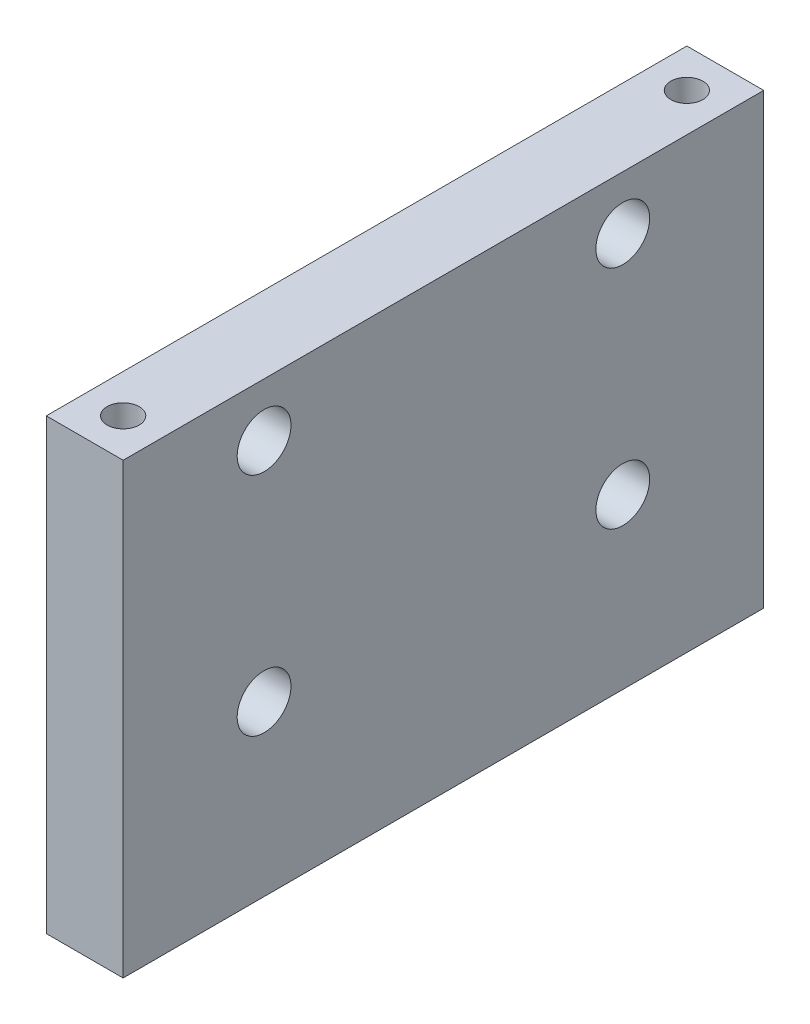
ISO-10303-21;
HEADER;
FILE_DESCRIPTION(('STEP AP214'),'2;1');
FILE_NAME('part.step','',(''),(''),'','','');
FILE_SCHEMA(('AUTOMOTIVE_DESIGN { 1 0 10303 214 1 1 1 1 }'));
ENDSEC;
DATA;
#1=APPLICATION_CONTEXT('core data for automotive mechanical design processes');
#2=APPLICATION_PROTOCOL_DEFINITION('international standard','automotive_design',2000,#1);
#3=PRODUCT_CONTEXT('',#1,'mechanical');
#4=PRODUCT('Part','Part','',(#3));
#5=PRODUCT_RELATED_PRODUCT_CATEGORY('part','',(#4));
#6=PRODUCT_DEFINITION_FORMATION('','',#4);
#7=PRODUCT_DEFINITION_CONTEXT('part definition',#1,'design');
#8=PRODUCT_DEFINITION('design','',#6,#7);
#9=PRODUCT_DEFINITION_SHAPE('','',#8);
#10=(LENGTH_UNIT() NAMED_UNIT(*) SI_UNIT(.MILLI.,.METRE.));
#11=(NAMED_UNIT(*) PLANE_ANGLE_UNIT() SI_UNIT($,.RADIAN.));
#12=(NAMED_UNIT(*) SI_UNIT($,.STERADIAN.) SOLID_ANGLE_UNIT());
#13=UNCERTAINTY_MEASURE_WITH_UNIT(LENGTH_MEASURE(1.E-05),#10,'distance_accuracy_value','');
#14=(GEOMETRIC_REPRESENTATION_CONTEXT(3) GLOBAL_UNCERTAINTY_ASSIGNED_CONTEXT((#13)) GLOBAL_UNIT_ASSIGNED_CONTEXT((#10,
#11,#12)) REPRESENTATION_CONTEXT('',''));
#15=CARTESIAN_POINT('',(0.,0.,0.));
#16=DIRECTION('',(0.,0.,1.));
#17=DIRECTION('',(1.,0.,0.));
#18=AXIS2_PLACEMENT_3D('',#15,#16,#17);
#19=CARTESIAN_POINT('',(0.,0.,0.));
#20=DIRECTION('',(0.,-1.,0.));
#21=DIRECTION('',(1.,0.,0.));
#22=AXIS2_PLACEMENT_3D('',#19,#20,#21);
#23=PLANE('',#22);
#24=CARTESIAN_POINT('',(-22.,0.,-22.));
#25=DIRECTION('',(0.,1.,0.));
#26=DIRECTION('',(0.,0.,-1.));
#27=AXIS2_PLACEMENT_3D('',#24,#25,#26);
#28=CIRCLE('',#27,1.25);
#29=CARTESIAN_POINT('',(-22.,0.,-23.25));
#30=VERTEX_POINT('',#29);
#31=EDGE_CURVE('E184',#30,#30,#28,.T.);
#32=ORIENTED_EDGE('',*,*,#31,.F.);
#33=EDGE_LOOP('',(#32));
#34=FACE_BOUND('',#33,.T.);
#35=DIRECTION('',(0.,0.,1.));
#36=VECTOR('',#35,1.);
#37=CARTESIAN_POINT('',(-25.,0.,0.));
#38=LINE('',#37,#36);
#39=CARTESIAN_POINT('',(-25.,0.,-25.));
#40=VERTEX_POINT('',#39);
#41=CARTESIAN_POINT('',(-25.,0.,25.));
#42=VERTEX_POINT('',#41);
#43=EDGE_CURVE('E27',#40,#42,#38,.T.);
#44=ORIENTED_EDGE('',*,*,#43,.T.);
#45=DIRECTION('',(1.,0.,0.));
#46=VECTOR('',#45,1.);
#47=CARTESIAN_POINT('',(0.,0.,25.));
#48=LINE('',#47,#46);
#49=CARTESIAN_POINT('',(-19.,0.,25.));
#50=VERTEX_POINT('',#49);
#51=EDGE_CURVE('E11',#42,#50,#48,.T.);
#52=ORIENTED_EDGE('',*,*,#51,.T.);
#53=DIRECTION('',(0.,0.,-1.));
#54=VECTOR('',#53,1.);
#55=CARTESIAN_POINT('',(-19.,0.,23.5));
#56=LINE('',#55,#54);
#57=CARTESIAN_POINT('',(-19.,0.,-25.));
#58=VERTEX_POINT('',#57);
#59=EDGE_CURVE('E113',#50,#58,#56,.T.);
#60=ORIENTED_EDGE('',*,*,#59,.T.);
#61=DIRECTION('',(1.,0.,0.));
#62=VECTOR('',#61,1.);
#63=CARTESIAN_POINT('',(0.,0.,-25.));
#64=LINE('',#63,#62);
#65=EDGE_CURVE('E111',#40,#58,#64,.T.);
#66=ORIENTED_EDGE('',*,*,#65,.F.);
#67=EDGE_LOOP('',(#44,#52,#60,#66));
#68=FACE_BOUND('',#67,.T.);
#69=CARTESIAN_POINT('',(-22.,0.,22.));
#70=DIRECTION('',(0.,-1.,0.));
#71=DIRECTION('',(0.,0.,-1.));
#72=AXIS2_PLACEMENT_3D('',#69,#70,#71);
#73=CIRCLE('',#72,1.25);
#74=CARTESIAN_POINT('',(-22.,0.,20.75));
#75=VERTEX_POINT('',#74);
#76=EDGE_CURVE('E194',#75,#75,#73,.T.);
#77=ORIENTED_EDGE('',*,*,#76,.T.);
#78=EDGE_LOOP('',(#77));
#79=FACE_BOUND('',#78,.T.);
#80=ADVANCED_FACE('F17',(#34,#68,#79),#23,.F.);
#81=CARTESIAN_POINT('',(15.6554577499628,-35.,0.));
#82=DIRECTION('',(0.,-1.,0.));
#83=DIRECTION('',(1.,0.,0.));
#84=AXIS2_PLACEMENT_3D('',#81,#82,#83);
#85=PLANE('',#84);
#86=CARTESIAN_POINT('',(-22.,-35.,-22.));
#87=DIRECTION('',(0.,1.,0.));
#88=DIRECTION('',(0.,0.,-1.));
#89=AXIS2_PLACEMENT_3D('',#86,#87,#88);
#90=CIRCLE('',#89,1.25);
#91=CARTESIAN_POINT('',(-22.,-35.,-23.25));
#92=VERTEX_POINT('',#91);
#93=EDGE_CURVE('E121',#92,#92,#90,.T.);
#94=ORIENTED_EDGE('',*,*,#93,.T.);
#95=EDGE_LOOP('',(#94));
#96=FACE_BOUND('',#95,.T.);
#97=DIRECTION('',(0.,0.,1.));
#98=VECTOR('',#97,1.);
#99=CARTESIAN_POINT('',(-25.,-35.,0.));
#100=LINE('',#99,#98);
#101=CARTESIAN_POINT('',(-25.,-35.,-25.));
#102=VERTEX_POINT('',#101);
#103=CARTESIAN_POINT('',(-25.,-35.,25.));
#104=VERTEX_POINT('',#103);
#105=EDGE_CURVE('E74',#102,#104,#100,.T.);
#106=ORIENTED_EDGE('',*,*,#105,.F.);
#107=DIRECTION('',(1.,0.,0.));
#108=VECTOR('',#107,1.);
#109=CARTESIAN_POINT('',(0.,-35.,-25.));
#110=LINE('',#109,#108);
#111=CARTESIAN_POINT('',(-19.,-35.,-25.));
#112=VERTEX_POINT('',#111);
#113=EDGE_CURVE('E89',#102,#112,#110,.T.);
#114=ORIENTED_EDGE('',*,*,#113,.T.);
#115=DIRECTION('',(0.,0.,-1.));
#116=VECTOR('',#115,1.);
#117=CARTESIAN_POINT('',(-19.,-35.,23.5));
#118=LINE('',#117,#116);
#119=CARTESIAN_POINT('',(-19.,-35.,25.));
#120=VERTEX_POINT('',#119);
#121=EDGE_CURVE('E92',#120,#112,#118,.T.);
#122=ORIENTED_EDGE('',*,*,#121,.F.);
#123=DIRECTION('',(1.,0.,0.));
#124=VECTOR('',#123,1.);
#125=CARTESIAN_POINT('',(0.,-35.,25.));
#126=LINE('',#125,#124);
#127=EDGE_CURVE('E82',#104,#120,#126,.T.);
#128=ORIENTED_EDGE('',*,*,#127,.F.);
#129=EDGE_LOOP('',(#106,#114,#122,#128));
#130=FACE_BOUND('',#129,.T.);
#131=CARTESIAN_POINT('',(-22.,-35.,22.));
#132=DIRECTION('',(0.,-1.,0.));
#133=DIRECTION('',(0.,0.,-1.));
#134=AXIS2_PLACEMENT_3D('',#131,#132,#133);
#135=CIRCLE('',#134,1.25);
#136=CARTESIAN_POINT('',(-22.,-35.,20.75));
#137=VERTEX_POINT('',#136);
#138=EDGE_CURVE('E103',#137,#137,#135,.T.);
#139=ORIENTED_EDGE('',*,*,#138,.F.);
#140=EDGE_LOOP('',(#139));
#141=FACE_BOUND('',#140,.T.);
#142=ADVANCED_FACE('F86',(#96,#130,#141),#85,.T.);
#143=CARTESIAN_POINT('',(0.,-35.002,-25.));
#144=DIRECTION('',(0.,0.,1.));
#145=DIRECTION('',(1.,0.,0.));
#146=AXIS2_PLACEMENT_3D('',#143,#144,#145);
#147=PLANE('',#146);
#148=ORIENTED_EDGE('',*,*,#113,.F.);
#149=DIRECTION('',(0.,1.,0.));
#150=VECTOR('',#149,1.);
#151=CARTESIAN_POINT('',(-25.,-35.002,-25.));
#152=LINE('',#151,#150);
#153=EDGE_CURVE('E71',#102,#40,#152,.T.);
#154=ORIENTED_EDGE('',*,*,#153,.T.);
#155=ORIENTED_EDGE('',*,*,#65,.T.);
#156=DIRECTION('',(0.,1.,0.));
#157=VECTOR('',#156,1.);
#158=CARTESIAN_POINT('',(-19.,-35.002,-25.));
#159=LINE('',#158,#157);
#160=EDGE_CURVE('E81',#112,#58,#159,.T.);
#161=ORIENTED_EDGE('',*,*,#160,.F.);
#162=EDGE_LOOP('',(#148,#154,#155,#161));
#163=FACE_BOUND('',#162,.T.);
#164=ADVANCED_FACE('F94',(#163),#147,.F.);
#165=CARTESIAN_POINT('',(-19.,-35.002,23.5));
#166=DIRECTION('',(1.,0.,0.));
#167=DIRECTION('',(0.,0.,-1.));
#168=AXIS2_PLACEMENT_3D('',#165,#166,#167);
#169=PLANE('',#168);
#170=CARTESIAN_POINT('',(-19.,-21.8226209229073,14.));
#171=DIRECTION('',(1.,0.,0.));
#172=DIRECTION('',(0.,0.,-1.));
#173=AXIS2_PLACEMENT_3D('',#170,#171,#172);
#174=CIRCLE('',#173,2.1);
#175=CARTESIAN_POINT('',(-19.,-21.8226209229073,11.9));
#176=VERTEX_POINT('',#175);
#177=EDGE_CURVE('E163',#176,#176,#174,.F.);
#178=ORIENTED_EDGE('',*,*,#177,.T.);
#179=EDGE_LOOP('',(#178));
#180=FACE_BOUND('',#179,.T.);
#181=CARTESIAN_POINT('',(-19.,-4.17737907709263,-14.));
#182=DIRECTION('',(1.,0.,0.));
#183=DIRECTION('',(0.,0.,-1.));
#184=AXIS2_PLACEMENT_3D('',#181,#182,#183);
#185=CIRCLE('',#184,2.1);
#186=CARTESIAN_POINT('',(-19.,-4.17737907709263,-16.1));
#187=VERTEX_POINT('',#186);
#188=EDGE_CURVE('E167',#187,#187,#185,.F.);
#189=ORIENTED_EDGE('',*,*,#188,.T.);
#190=EDGE_LOOP('',(#189));
#191=FACE_BOUND('',#190,.T.);
#192=CARTESIAN_POINT('',(-19.,-21.8226209229073,-14.));
#193=DIRECTION('',(1.,0.,0.));
#194=DIRECTION('',(0.,0.,-1.));
#195=AXIS2_PLACEMENT_3D('',#192,#193,#194);
#196=CIRCLE('',#195,2.1);
#197=CARTESIAN_POINT('',(-19.,-21.8226209229073,-16.1));
#198=VERTEX_POINT('',#197);
#199=EDGE_CURVE('E171',#198,#198,#196,.F.);
#200=ORIENTED_EDGE('',*,*,#199,.T.);
#201=EDGE_LOOP('',(#200));
#202=FACE_BOUND('',#201,.T.);
#203=CARTESIAN_POINT('',(-19.,-4.17737907709263,14.));
#204=DIRECTION('',(1.,0.,0.));
#205=DIRECTION('',(0.,0.,-1.));
#206=AXIS2_PLACEMENT_3D('',#203,#204,#205);
#207=CIRCLE('',#206,2.1);
#208=CARTESIAN_POINT('',(-19.,-4.17737907709263,11.9));
#209=VERTEX_POINT('',#208);
#210=EDGE_CURVE('E174',#209,#209,#207,.F.);
#211=ORIENTED_EDGE('',*,*,#210,.T.);
#212=EDGE_LOOP('',(#211));
#213=FACE_BOUND('',#212,.T.);
#214=DIRECTION('',(0.,1.,0.));
#215=VECTOR('',#214,1.);
#216=CARTESIAN_POINT('',(-19.,-35.002,25.));
#217=LINE('',#216,#215);
#218=EDGE_CURVE('E48',#120,#50,#217,.T.);
#219=ORIENTED_EDGE('',*,*,#218,.F.);
#220=ORIENTED_EDGE('',*,*,#121,.T.);
#221=ORIENTED_EDGE('',*,*,#160,.T.);
#222=ORIENTED_EDGE('',*,*,#59,.F.);
#223=EDGE_LOOP('',(#219,#220,#221,#222));
#224=FACE_BOUND('',#223,.T.);
#225=ADVANCED_FACE('F129',(#180,#191,#202,#213,#224),#169,.T.);
#226=CARTESIAN_POINT('',(-25.,-35.002,0.));
#227=DIRECTION('',(-1.,0.,0.));
#228=DIRECTION('',(0.,0.,1.));
#229=AXIS2_PLACEMENT_3D('',#226,#227,#228);
#230=PLANE('',#229);
#231=CARTESIAN_POINT('',(-25.,-21.8226209229073,14.));
#232=DIRECTION('',(-1.,0.,0.));
#233=DIRECTION('',(0.,0.,1.));
#234=AXIS2_PLACEMENT_3D('',#231,#232,#233);
#235=CIRCLE('',#234,2.1);
#236=CARTESIAN_POINT('',(-25.,-21.8226209229073,16.1));
#237=VERTEX_POINT('',#236);
#238=EDGE_CURVE('E178',#237,#237,#235,.T.);
#239=ORIENTED_EDGE('',*,*,#238,.F.);
#240=EDGE_LOOP('',(#239));
#241=FACE_BOUND('',#240,.T.);
#242=CARTESIAN_POINT('',(-25.,-4.17737907709263,-14.));
#243=DIRECTION('',(-1.,0.,0.));
#244=DIRECTION('',(0.,0.,1.));
#245=AXIS2_PLACEMENT_3D('',#242,#243,#244);
#246=CIRCLE('',#245,2.1);
#247=CARTESIAN_POINT('',(-25.,-4.17737907709263,-11.9));
#248=VERTEX_POINT('',#247);
#249=EDGE_CURVE('E396',#248,#248,#246,.T.);
#250=ORIENTED_EDGE('',*,*,#249,.F.);
#251=EDGE_LOOP('',(#250));
#252=FACE_BOUND('',#251,.T.);
#253=CARTESIAN_POINT('',(-25.,-21.8226209229073,-14.));
#254=DIRECTION('',(-1.,0.,0.));
#255=DIRECTION('',(0.,0.,1.));
#256=AXIS2_PLACEMENT_3D('',#253,#254,#255);
#257=CIRCLE('',#256,2.1);
#258=CARTESIAN_POINT('',(-25.,-21.8226209229073,-11.9));
#259=VERTEX_POINT('',#258);
#260=EDGE_CURVE('E404',#259,#259,#257,.T.);
#261=ORIENTED_EDGE('',*,*,#260,.F.);
#262=EDGE_LOOP('',(#261));
#263=FACE_BOUND('',#262,.T.);
#264=CARTESIAN_POINT('',(-25.,-4.17737907709263,14.));
#265=DIRECTION('',(-1.,0.,0.));
#266=DIRECTION('',(0.,0.,1.));
#267=AXIS2_PLACEMENT_3D('',#264,#265,#266);
#268=CIRCLE('',#267,2.1);
#269=CARTESIAN_POINT('',(-25.,-4.17737907709263,16.1));
#270=VERTEX_POINT('',#269);
#271=EDGE_CURVE('E177',#270,#270,#268,.T.);
#272=ORIENTED_EDGE('',*,*,#271,.F.);
#273=EDGE_LOOP('',(#272));
#274=FACE_BOUND('',#273,.T.);
#275=ORIENTED_EDGE('',*,*,#153,.F.);
#276=ORIENTED_EDGE('',*,*,#105,.T.);
#277=DIRECTION('',(0.,1.,0.));
#278=VECTOR('',#277,1.);
#279=CARTESIAN_POINT('',(-25.,-35.002,25.));
#280=LINE('',#279,#278);
#281=EDGE_CURVE('E21',#104,#42,#280,.T.);
#282=ORIENTED_EDGE('',*,*,#281,.T.);
#283=ORIENTED_EDGE('',*,*,#43,.F.);
#284=EDGE_LOOP('',(#275,#276,#282,#283));
#285=FACE_BOUND('',#284,.T.);
#286=ADVANCED_FACE('F73',(#241,#252,#263,#274,#285),#230,.T.);
#287=CARTESIAN_POINT('',(0.,-35.002,25.));
#288=DIRECTION('',(0.,0.,1.));
#289=DIRECTION('',(1.,0.,0.));
#290=AXIS2_PLACEMENT_3D('',#287,#288,#289);
#291=PLANE('',#290);
#292=ORIENTED_EDGE('',*,*,#281,.F.);
#293=ORIENTED_EDGE('',*,*,#127,.T.);
#294=ORIENTED_EDGE('',*,*,#218,.T.);
#295=ORIENTED_EDGE('',*,*,#51,.F.);
#296=EDGE_LOOP('',(#292,#293,#294,#295));
#297=FACE_BOUND('',#296,.T.);
#298=ADVANCED_FACE('F19',(#297),#291,.T.);
#299=CARTESIAN_POINT('',(-22.,-25.,-22.));
#300=DIRECTION('',(0.,-1.,0.));
#301=DIRECTION('',(0.,0.,-1.));
#302=AXIS2_PLACEMENT_3D('',#299,#300,#301);
#303=CYLINDRICAL_SURFACE('',#302,1.25);
#304=CARTESIAN_POINT('',(-22.,-25.,-22.));
#305=DIRECTION('',(0.,1.,0.));
#306=DIRECTION('',(0.,0.,-1.));
#307=AXIS2_PLACEMENT_3D('',#304,#305,#306);
#308=CIRCLE('',#307,1.25);
#309=CARTESIAN_POINT('',(-22.,-25.,-23.25));
#310=VERTEX_POINT('',#309);
#311=EDGE_CURVE('E207',#310,#310,#308,.T.);
#312=ORIENTED_EDGE('',*,*,#311,.T.);
#313=EDGE_LOOP('',(#312));
#314=FACE_BOUND('',#313,.T.);
#315=ORIENTED_EDGE('',*,*,#93,.F.);
#316=EDGE_LOOP('',(#315));
#317=FACE_BOUND('',#316,.T.);
#318=ADVANCED_FACE('F133',(#314,#317),#303,.F.);
#319=CARTESIAN_POINT('',(-0.875,-25.,0.));
#320=DIRECTION('',(0.,-1.,0.));
#321=DIRECTION('',(1.,0.,0.));
#322=AXIS2_PLACEMENT_3D('',#319,#320,#321);
#323=PLANE('',#322);
#324=ORIENTED_EDGE('',*,*,#311,.F.);
#325=EDGE_LOOP('',(#324));
#326=FACE_BOUND('',#325,.T.);
#327=ADVANCED_FACE('F139',(#326),#323,.T.);
#328=CARTESIAN_POINT('',(-22.,-25.,22.));
#329=DIRECTION('',(0.,-1.,0.));
#330=DIRECTION('',(0.,0.,-1.));
#331=AXIS2_PLACEMENT_3D('',#328,#329,#330);
#332=CYLINDRICAL_SURFACE('',#331,1.25);
#333=CARTESIAN_POINT('',(-22.,-25.,22.));
#334=DIRECTION('',(0.,-1.,0.));
#335=DIRECTION('',(0.,0.,-1.));
#336=AXIS2_PLACEMENT_3D('',#333,#334,#335);
#337=CIRCLE('',#336,1.25);
#338=CARTESIAN_POINT('',(-22.,-25.,20.75));
#339=VERTEX_POINT('',#338);
#340=EDGE_CURVE('E96',#339,#339,#337,.T.);
#341=ORIENTED_EDGE('',*,*,#340,.F.);
#342=EDGE_LOOP('',(#341));
#343=FACE_BOUND('',#342,.T.);
#344=ORIENTED_EDGE('',*,*,#138,.T.);
#345=EDGE_LOOP('',(#344));
#346=FACE_BOUND('',#345,.T.);
#347=ADVANCED_FACE('F265',(#343,#346),#332,.F.);
#348=CARTESIAN_POINT('',(-0.875,-25.,0.));
#349=DIRECTION('',(0.,-1.,0.));
#350=DIRECTION('',(1.,0.,0.));
#351=AXIS2_PLACEMENT_3D('',#348,#349,#350);
#352=PLANE('',#351);
#353=ORIENTED_EDGE('',*,*,#340,.T.);
#354=EDGE_LOOP('',(#353));
#355=FACE_BOUND('',#354,.T.);
#356=ADVANCED_FACE('F275',(#355),#352,.T.);
#357=CARTESIAN_POINT('',(-22.,-10.,-22.));
#358=DIRECTION('',(0.,1.,0.));
#359=DIRECTION('',(0.,0.,1.));
#360=AXIS2_PLACEMENT_3D('',#357,#358,#359);
#361=CYLINDRICAL_SURFACE('',#360,1.25);
#362=CARTESIAN_POINT('',(-22.,-10.,-22.));
#363=DIRECTION('',(0.,1.,0.));
#364=DIRECTION('',(0.,0.,-1.));
#365=AXIS2_PLACEMENT_3D('',#362,#363,#364);
#366=CIRCLE('',#365,1.25);
#367=CARTESIAN_POINT('',(-22.,-10.,-23.25));
#368=VERTEX_POINT('',#367);
#369=EDGE_CURVE('E198',#368,#368,#366,.T.);
#370=ORIENTED_EDGE('',*,*,#369,.F.);
#371=EDGE_LOOP('',(#370));
#372=FACE_BOUND('',#371,.T.);
#373=ORIENTED_EDGE('',*,*,#31,.T.);
#374=EDGE_LOOP('',(#373));
#375=FACE_BOUND('',#374,.T.);
#376=ADVANCED_FACE('F285',(#372,#375),#361,.F.);
#377=CARTESIAN_POINT('',(-0.875,-10.,0.));
#378=DIRECTION('',(0.,1.,0.));
#379=DIRECTION('',(1.,0.,0.));
#380=AXIS2_PLACEMENT_3D('',#377,#378,#379);
#381=PLANE('',#380);
#382=ORIENTED_EDGE('',*,*,#369,.T.);
#383=EDGE_LOOP('',(#382));
#384=FACE_BOUND('',#383,.T.);
#385=ADVANCED_FACE('F296',(#384),#381,.T.);
#386=CARTESIAN_POINT('',(-22.,-10.,22.));
#387=DIRECTION('',(0.,1.,0.));
#388=DIRECTION('',(0.,0.,1.));
#389=AXIS2_PLACEMENT_3D('',#386,#387,#388);
#390=CYLINDRICAL_SURFACE('',#389,1.25);
#391=CARTESIAN_POINT('',(-22.,-10.,22.));
#392=DIRECTION('',(0.,-1.,0.));
#393=DIRECTION('',(0.,0.,-1.));
#394=AXIS2_PLACEMENT_3D('',#391,#392,#393);
#395=CIRCLE('',#394,1.25);
#396=CARTESIAN_POINT('',(-22.,-10.,20.75));
#397=VERTEX_POINT('',#396);
#398=EDGE_CURVE('E190',#397,#397,#395,.T.);
#399=ORIENTED_EDGE('',*,*,#398,.T.);
#400=EDGE_LOOP('',(#399));
#401=FACE_BOUND('',#400,.T.);
#402=ORIENTED_EDGE('',*,*,#76,.F.);
#403=EDGE_LOOP('',(#402));
#404=FACE_BOUND('',#403,.T.);
#405=ADVANCED_FACE('F308',(#401,#404),#390,.F.);
#406=CARTESIAN_POINT('',(-0.875,-10.,0.));
#407=DIRECTION('',(0.,1.,0.));
#408=DIRECTION('',(1.,0.,0.));
#409=AXIS2_PLACEMENT_3D('',#406,#407,#408);
#410=PLANE('',#409);
#411=ORIENTED_EDGE('',*,*,#398,.F.);
#412=EDGE_LOOP('',(#411));
#413=FACE_BOUND('',#412,.T.);
#414=ADVANCED_FACE('F320',(#413),#410,.T.);
#415=CARTESIAN_POINT('',(-18.998,-4.17737907709263,14.));
#416=DIRECTION('',(-1.,0.,0.));
#417=DIRECTION('',(0.,0.,1.));
#418=AXIS2_PLACEMENT_3D('',#415,#416,#417);
#419=CYLINDRICAL_SURFACE('',#418,2.1);
#420=ORIENTED_EDGE('',*,*,#271,.T.);
#421=EDGE_LOOP('',(#420));
#422=FACE_BOUND('',#421,.T.);
#423=ORIENTED_EDGE('',*,*,#210,.F.);
#424=EDGE_LOOP('',(#423));
#425=FACE_BOUND('',#424,.T.);
#426=ADVANCED_FACE('F330',(#422,#425),#419,.F.);
#427=CARTESIAN_POINT('',(-18.998,-21.8226209229073,-14.));
#428=DIRECTION('',(-1.,0.,0.));
#429=DIRECTION('',(0.,0.,1.));
#430=AXIS2_PLACEMENT_3D('',#427,#428,#429);
#431=CYLINDRICAL_SURFACE('',#430,2.1);
#432=ORIENTED_EDGE('',*,*,#260,.T.);
#433=EDGE_LOOP('',(#432));
#434=FACE_BOUND('',#433,.T.);
#435=ORIENTED_EDGE('',*,*,#199,.F.);
#436=EDGE_LOOP('',(#435));
#437=FACE_BOUND('',#436,.T.);
#438=ADVANCED_FACE('F341',(#434,#437),#431,.F.);
#439=CARTESIAN_POINT('',(-18.998,-4.17737907709263,-14.));
#440=DIRECTION('',(-1.,0.,0.));
#441=DIRECTION('',(0.,0.,1.));
#442=AXIS2_PLACEMENT_3D('',#439,#440,#441);
#443=CYLINDRICAL_SURFACE('',#442,2.1);
#444=ORIENTED_EDGE('',*,*,#249,.T.);
#445=EDGE_LOOP('',(#444));
#446=FACE_BOUND('',#445,.T.);
#447=ORIENTED_EDGE('',*,*,#188,.F.);
#448=EDGE_LOOP('',(#447));
#449=FACE_BOUND('',#448,.T.);
#450=ADVANCED_FACE('F354',(#446,#449),#443,.F.);
#451=CARTESIAN_POINT('',(-18.998,-21.8226209229073,14.));
#452=DIRECTION('',(-1.,0.,0.));
#453=DIRECTION('',(0.,0.,1.));
#454=AXIS2_PLACEMENT_3D('',#451,#452,#453);
#455=CYLINDRICAL_SURFACE('',#454,2.1);
#456=ORIENTED_EDGE('',*,*,#238,.T.);
#457=EDGE_LOOP('',(#456));
#458=FACE_BOUND('',#457,.T.);
#459=ORIENTED_EDGE('',*,*,#177,.F.);
#460=EDGE_LOOP('',(#459));
#461=FACE_BOUND('',#460,.T.);
#462=ADVANCED_FACE('F365',(#458,#461),#455,.F.);
#463=CLOSED_SHELL('',(#80,#142,#164,#225,#286,#298,#318,#327,#347,#356,#376,#385,#405,#414,#426,
#438,#450,#462));
#464=MANIFOLD_SOLID_BREP('B1',#463);
#465=ADVANCED_BREP_SHAPE_REPRESENTATION('',(#18,#464),#14);
#466=SHAPE_DEFINITION_REPRESENTATION(#9,#465);
ENDSEC;
END-ISO-10303-21;
